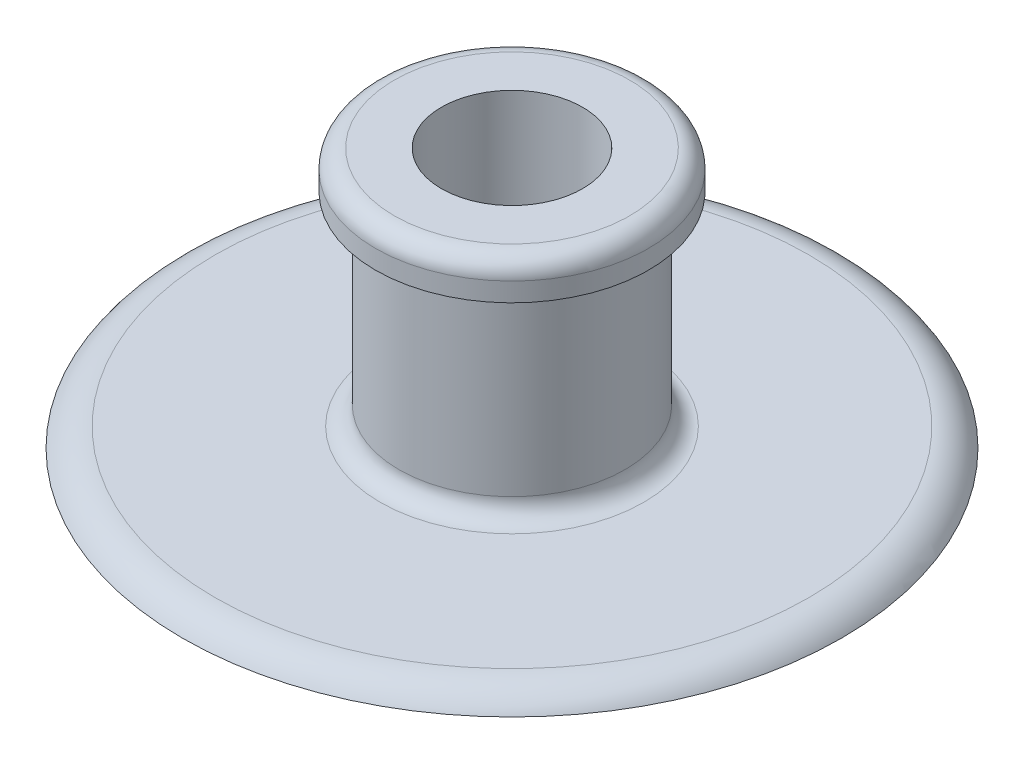
ISO-10303-21;
HEADER;
FILE_DESCRIPTION(('STEP AP214'),'2;1');
FILE_NAME('part.step','',(''),(''),'','','');
FILE_SCHEMA(('AUTOMOTIVE_DESIGN { 1 0 10303 214 1 1 1 1 }'));
ENDSEC;
DATA;
#1=APPLICATION_CONTEXT('core data for automotive mechanical design processes');
#2=APPLICATION_PROTOCOL_DEFINITION('international standard','automotive_design',2000,#1);
#3=PRODUCT_CONTEXT('',#1,'mechanical');
#4=PRODUCT('Part','Part','',(#3));
#5=PRODUCT_RELATED_PRODUCT_CATEGORY('part','',(#4));
#6=PRODUCT_DEFINITION_FORMATION('','',#4);
#7=PRODUCT_DEFINITION_CONTEXT('part definition',#1,'design');
#8=PRODUCT_DEFINITION('design','',#6,#7);
#9=PRODUCT_DEFINITION_SHAPE('','',#8);
#10=(LENGTH_UNIT() NAMED_UNIT(*) SI_UNIT(.MILLI.,.METRE.));
#11=(NAMED_UNIT(*) PLANE_ANGLE_UNIT() SI_UNIT($,.RADIAN.));
#12=(NAMED_UNIT(*) SI_UNIT($,.STERADIAN.) SOLID_ANGLE_UNIT());
#13=UNCERTAINTY_MEASURE_WITH_UNIT(LENGTH_MEASURE(1.E-05),#10,'distance_accuracy_value','');
#14=(GEOMETRIC_REPRESENTATION_CONTEXT(3) GLOBAL_UNCERTAINTY_ASSIGNED_CONTEXT((#13)) GLOBAL_UNIT_ASSIGNED_CONTEXT((#10,
#11,#12)) REPRESENTATION_CONTEXT('',''));
#15=CARTESIAN_POINT('',(0.,0.,0.));
#16=DIRECTION('',(0.,0.,1.));
#17=DIRECTION('',(1.,0.,0.));
#18=AXIS2_PLACEMENT_3D('',#15,#16,#17);
#19=CARTESIAN_POINT('',(0.,17.526,0.));
#20=DIRECTION('',(0.,-1.,0.));
#21=DIRECTION('',(0.,0.,-1.));
#22=AXIS2_PLACEMENT_3D('',#19,#20,#21);
#23=CYLINDRICAL_SURFACE('',#22,7.62);
#24=CARTESIAN_POINT('',(0.,2.54,0.));
#25=DIRECTION('',(0.,1.,0.));
#26=DIRECTION('',(0.,0.,1.));
#27=AXIS2_PLACEMENT_3D('',#24,#25,#26);
#28=CIRCLE('',#27,7.62);
#29=CARTESIAN_POINT('',(-7.60304780992465,2.54,0.508));
#30=VERTEX_POINT('',#29);
#31=CARTESIAN_POINT('',(-7.60304780992465,2.54,-0.508));
#32=VERTEX_POINT('',#31);
#33=EDGE_CURVE('E72',#30,#32,#28,.T.);
#34=ORIENTED_EDGE('',*,*,#33,.T.);
#35=CARTESIAN_POINT('',(-7.60304780992465,2.54,-0.508));
#36=CARTESIAN_POINT('',(-7.60304159913848,2.56854500472977,-0.508024419889921));
#37=CARTESIAN_POINT('',(-7.6032083918163,2.59708204511704,-0.505595520602762));
#38=CARTESIAN_POINT('',(-7.60384202740722,2.65332480571844,-0.496011945855968));
#39=CARTESIAN_POINT('',(-7.60430862281067,2.68103119196927,-0.488861168526517));
#40=CARTESIAN_POINT('',(-7.60549630031561,2.73485838226822,-0.470010144838582));
#41=CARTESIAN_POINT('',(-7.6062174905976,2.76097850675596,-0.458307964317557));
#42=CARTESIAN_POINT('',(-7.60783091050641,2.81087994607243,-0.430697807624481));
#43=CARTESIAN_POINT('',(-7.60872311231095,2.83466164039492,-0.414790515432525));
#44=CARTESIAN_POINT('',(-7.61058014569907,2.87925291563377,-0.379192064712161));
#45=CARTESIAN_POINT('',(-7.61154507770351,2.90005826783693,-0.359495613934338));
#46=CARTESIAN_POINT('',(-7.6134379015252,2.93807280132225,-0.316886882872765));
#47=CARTESIAN_POINT('',(-7.61436578768412,2.95528143493364,-0.293974113728251));
#48=CARTESIAN_POINT('',(-7.61608080018844,2.98562463883698,-0.245559696866007));
#49=CARTESIAN_POINT('',(-7.61686780028951,2.99875556286249,-0.220055759024563));
#50=CARTESIAN_POINT('',(-7.61821120969799,3.0205465398851,-0.167200693188867));
#51=CARTESIAN_POINT('',(-7.61876763585791,3.02920691964289,-0.139849700364712));
#52=CARTESIAN_POINT('',(-7.61958654889922,3.04179977002285,-0.0841184733450809));
#53=CARTESIAN_POINT('',(-7.61984947024981,3.04573922956415,-0.0557398248352981));
#54=CARTESIAN_POINT('',(-7.62005321594405,3.0488000179062,0.0012777706864837));
#55=CARTESIAN_POINT('',(-7.61999403640109,3.04792128856874,0.0299167208352248));
#56=CARTESIAN_POINT('',(-7.61956059875644,3.04137622889067,0.0865930353110984));
#57=CARTESIAN_POINT('',(-7.61918684467766,3.03571755709752,0.114631288448523));
#58=CARTESIAN_POINT('',(-7.61816691307493,3.01978515372002,0.169358959953931));
#59=CARTESIAN_POINT('',(-7.61752073500966,3.00951141296538,0.196048375641614));
#60=CARTESIAN_POINT('',(-7.61602781621613,2.98463160725771,0.24734596255558));
#61=CARTESIAN_POINT('',(-7.61518091110856,2.97002198908397,0.271952405461684));
#62=CARTESIAN_POINT('',(-7.61338188836435,2.9368884878819,0.318365359038743));
#63=CARTESIAN_POINT('',(-7.61242977431608,2.91836473833384,0.340171965149382));
#64=CARTESIAN_POINT('',(-7.6105253392327,2.87788828072959,0.38040947749293));
#65=CARTESIAN_POINT('',(-7.60957302095305,2.8559294156666,0.398834190679327));
#66=CARTESIAN_POINT('',(-7.60777704096159,2.8092192031015,0.431742171811899));
#67=CARTESIAN_POINT('',(-7.6069334131665,2.78446698843656,0.446224211013446));
#68=CARTESIAN_POINT('',(-7.60544970147519,2.73286129533023,0.470836295868986));
#69=CARTESIAN_POINT('',(-7.6048097539302,2.70600642421427,0.480963427769705));
#70=CARTESIAN_POINT('',(-7.60380884052496,2.65100541670298,0.496543834199147));
#71=CARTESIAN_POINT('',(-7.60344745055639,2.62286131268274,0.50200421531452));
#72=CARTESIAN_POINT('',(-7.60311259522002,2.57637816684044,0.50702574474653));
#73=CARTESIAN_POINT('',(-7.60304598021525,2.55818443795279,0.508008081311065));
#74=CARTESIAN_POINT('',(-7.60304780992465,2.54,0.508));
#75=B_SPLINE_CURVE_WITH_KNOTS('',3,(#35,#36,#37,#38,#39,#40,#41,#42,#43,#44,#45,#46,#47,#48,#49,
#50,#51,#52,#53,#54,#55,#56,#57,#58,#59,#60,#61,#62,#63,#64,#65,#66,#67,#68,#69,#70,#71,#72,#73,
#74),.UNSPECIFIED.,.F.,.F.,(4,2,2,2,2,2,2,2,2,2,2,2,2,2,2,2,2,2,2,4),(0.,0.0855198395832717,
0.170969166674459,0.256454846024415,0.341926629295185,0.427518667715244,0.513123729717807,
0.598805120354975,0.684480247487369,0.770028382603848,0.855577549981033,0.940989907689777,
1.02640243511625,1.11188515168982,1.19736495358974,1.28299976067996,1.36866122560895,
1.45437991551918,1.53996783816012,1.59451934799155),.UNSPECIFIED.);
#76=EDGE_CURVE('E63',#32,#30,#75,.T.);
#77=ORIENTED_EDGE('',*,*,#76,.T.);
#78=EDGE_LOOP('',(#34,#77));
#79=FACE_BOUND('',#78,.T.);
#80=CARTESIAN_POINT('',(0.,14.986,0.));
#81=DIRECTION('',(0.,1.,0.));
#82=DIRECTION('',(0.,0.,1.));
#83=AXIS2_PLACEMENT_3D('',#80,#81,#82);
#84=CIRCLE('',#83,7.62);
#85=CARTESIAN_POINT('',(0.,14.986,7.62));
#86=VERTEX_POINT('',#85);
#87=EDGE_CURVE('E234',#86,#86,#84,.T.);
#88=ORIENTED_EDGE('',*,*,#87,.F.);
#89=EDGE_LOOP('',(#88));
#90=FACE_BOUND('',#89,.T.);
#91=ADVANCED_FACE('F33',(#79,#90),#23,.T.);
#92=CARTESIAN_POINT('',(0.,1.27,0.));
#93=DIRECTION('',(0.,1.,0.));
#94=DIRECTION('',(0.,0.,1.));
#95=AXIS2_PLACEMENT_3D('',#92,#93,#94);
#96=PLANE('',#95);
#97=CARTESIAN_POINT('',(0.,1.27,0.));
#98=DIRECTION('',(0.,1.,0.));
#99=DIRECTION('',(0.,0.,1.));
#100=AXIS2_PLACEMENT_3D('',#97,#98,#99);
#101=CIRCLE('',#100,20.0252954743875);
#102=CARTESIAN_POINT('',(0.,1.27,20.0252954743875));
#103=VERTEX_POINT('',#102);
#104=EDGE_CURVE('E67',#103,#103,#101,.T.);
#105=ORIENTED_EDGE('',*,*,#104,.T.);
#106=EDGE_LOOP('',(#105));
#107=FACE_BOUND('',#106,.T.);
#108=CARTESIAN_POINT('',(0.,1.27,0.));
#109=DIRECTION('',(0.,1.,0.));
#110=DIRECTION('',(0.,0.,1.));
#111=AXIS2_PLACEMENT_3D('',#108,#109,#110);
#112=CIRCLE('',#111,8.89);
#113=CARTESIAN_POINT('',(0.,1.27,8.89));
#114=VERTEX_POINT('',#113);
#115=EDGE_CURVE('E68',#114,#114,#112,.F.);
#116=ORIENTED_EDGE('',*,*,#115,.T.);
#117=EDGE_LOOP('',(#116));
#118=FACE_BOUND('',#117,.T.);
#119=ADVANCED_FACE('F133',(#107,#118),#96,.T.);
#120=CARTESIAN_POINT('',(0.,0.,0.));
#121=DIRECTION('',(0.,1.,0.));
#122=DIRECTION('',(0.,0.,1.));
#123=AXIS2_PLACEMENT_3D('',#120,#121,#122);
#124=PLANE('',#123);
#125=CARTESIAN_POINT('',(0.,0.,0.));
#126=DIRECTION('',(0.,1.,0.));
#127=DIRECTION('',(0.,0.,1.));
#128=AXIS2_PLACEMENT_3D('',#125,#126,#127);
#129=CIRCLE('',#128,7.3025);
#130=CARTESIAN_POINT('',(0.,0.,7.3025));
#131=VERTEX_POINT('',#130);
#132=EDGE_CURVE('E244',#131,#131,#129,.T.);
#133=ORIENTED_EDGE('',*,*,#132,.T.);
#134=EDGE_LOOP('',(#133));
#135=FACE_BOUND('',#134,.T.);
#136=CARTESIAN_POINT('',(0.,0.,0.));
#137=DIRECTION('',(0.,1.,0.));
#138=DIRECTION('',(0.,0.,1.));
#139=AXIS2_PLACEMENT_3D('',#136,#137,#138);
#140=CIRCLE('',#139,22.225);
#141=CARTESIAN_POINT('',(0.,0.,22.225));
#142=VERTEX_POINT('',#141);
#143=EDGE_CURVE('E77',#142,#142,#140,.T.);
#144=ORIENTED_EDGE('',*,*,#143,.F.);
#145=EDGE_LOOP('',(#144));
#146=FACE_BOUND('',#145,.T.);
#147=ADVANCED_FACE('F126',(#135,#146),#124,.F.);
#148=CARTESIAN_POINT('',(0.,17.526,0.));
#149=DIRECTION('',(0.,1.,0.));
#150=DIRECTION('',(0.,0.,1.));
#151=AXIS2_PLACEMENT_3D('',#148,#149,#150);
#152=PLANE('',#151);
#153=CARTESIAN_POINT('',(0.,17.526,0.));
#154=DIRECTION('',(0.,1.,0.));
#155=DIRECTION('',(0.,0.,1.));
#156=AXIS2_PLACEMENT_3D('',#153,#154,#155);
#157=CIRCLE('',#156,7.9375);
#158=CARTESIAN_POINT('',(0.,17.526,7.9375));
#159=VERTEX_POINT('',#158);
#160=EDGE_CURVE('E41',#159,#159,#157,.T.);
#161=ORIENTED_EDGE('',*,*,#160,.T.);
#162=EDGE_LOOP('',(#161));
#163=FACE_BOUND('',#162,.T.);
#164=CARTESIAN_POINT('',(0.,17.526,0.));
#165=DIRECTION('',(0.,1.,0.));
#166=DIRECTION('',(0.,0.,1.));
#167=AXIS2_PLACEMENT_3D('',#164,#165,#166);
#168=CIRCLE('',#167,4.7625);
#169=CARTESIAN_POINT('',(0.,17.526,4.7625));
#170=VERTEX_POINT('',#169);
#171=EDGE_CURVE('E82',#170,#170,#168,.T.);
#172=ORIENTED_EDGE('',*,*,#171,.F.);
#173=EDGE_LOOP('',(#172));
#174=FACE_BOUND('',#173,.T.);
#175=ADVANCED_FACE('F124',(#163,#174),#152,.T.);
#176=CARTESIAN_POINT('',(0.,0.,0.));
#177=DIRECTION('',(0.,1.,0.));
#178=DIRECTION('',(0.,0.,1.));
#179=AXIS2_PLACEMENT_3D('',#176,#177,#178);
#180=CYLINDRICAL_SURFACE('',#179,4.7625);
#181=CARTESIAN_POINT('',(-4.73532915962555,2.54,-0.508));
#182=CARTESIAN_POINT('',(-4.73532951382586,2.5115526378655,-0.507998772892873));
#183=CARTESIAN_POINT('',(-4.73558826875959,2.48308671810116,-0.50560242362926));
#184=CARTESIAN_POINT('',(-4.736595126622,2.4269448362749,-0.496079527026681));
#185=CARTESIAN_POINT('',(-4.73734376197426,2.39926976793976,-0.488947832982665));
#186=CARTESIAN_POINT('',(-4.73924463946746,2.34553069389832,-0.470164918632653));
#187=CARTESIAN_POINT('',(-4.74039662972051,2.31946569465578,-0.458516518441869));
#188=CARTESIAN_POINT('',(-4.74297410854784,2.26966613673176,-0.431036426024846));
#189=CARTESIAN_POINT('',(-4.74439954465004,2.24593113226172,-0.415205536165491));
#190=CARTESIAN_POINT('',(-4.74736987687672,2.20136217070842,-0.379739899712918));
#191=CARTESIAN_POINT('',(-4.74891519172266,2.18053916611075,-0.360091423030222));
#192=CARTESIAN_POINT('',(-4.75194737246049,2.14247968292137,-0.317577771402535));
#193=CARTESIAN_POINT('',(-4.75343423561961,2.12524337185562,-0.294712446289726));
#194=CARTESIAN_POINT('',(-4.75618616451338,2.09480828084614,-0.246346556419165));
#195=CARTESIAN_POINT('',(-4.75745069119588,2.0816192573942,-0.220839818936442));
#196=CARTESIAN_POINT('',(-4.75961089945925,2.05971556261992,-0.167957917534795));
#197=CARTESIAN_POINT('',(-4.76050659117781,2.05100076831857,-0.140582804993605));
#198=CARTESIAN_POINT('',(-4.76182526724337,2.03832520885966,-0.0848523131943555));
#199=CARTESIAN_POINT('',(-4.7622500465449,2.03434638751278,-0.0565010838523878));
#200=CARTESIAN_POINT('',(-4.76258514799953,2.03119982683689,0.000469692808714591));
#201=CARTESIAN_POINT('',(-4.76249548518658,2.03203194691388,0.0290892322624054));
#202=CARTESIAN_POINT('',(-4.76181326982975,2.03846903714722,0.0856615842895426));
#203=CARTESIAN_POINT('',(-4.7612227631284,2.04405459083451,0.113616634290427));
#204=CARTESIAN_POINT('',(-4.75960755158236,2.05980972115609,0.168190247448599));
#205=CARTESIAN_POINT('',(-4.7585828404379,2.06997936430015,0.194808791208514));
#206=CARTESIAN_POINT('',(-4.75621088477686,2.09463512615423,0.246014724712021));
#207=CARTESIAN_POINT('',(-4.75486300277581,2.10912979036327,0.270597969053422));
#208=CARTESIAN_POINT('',(-4.75199584180303,2.14201793669936,0.316990245302861));
#209=CARTESIAN_POINT('',(-4.7504765571086,2.16041154902037,0.338799184532182));
#210=CARTESIAN_POINT('',(-4.74742804404275,2.20068455414177,0.379137586231989));
#211=CARTESIAN_POINT('',(-4.74589880382353,2.2225808454003,0.397650180865433));
#212=CARTESIAN_POINT('',(-4.74301026139346,2.26917919741829,0.430739674682816));
#213=CARTESIAN_POINT('',(-4.74165095948828,2.29388126322457,0.445316566787349));
#214=CARTESIAN_POINT('',(-4.73925611632906,2.34540343195827,0.470121044486209));
#215=CARTESIAN_POINT('',(-4.73822065828665,2.37222407704054,0.480347512482386));
#216=CARTESIAN_POINT('',(-4.73659244041184,2.42721531641632,0.496147109141657));
#217=CARTESIAN_POINT('',(-4.73599966518854,2.4553858637411,0.501720399584123));
#218=CARTESIAN_POINT('',(-4.73532663560579,2.51212894902699,0.508033581476389));
#219=CARTESIAN_POINT('',(-4.73524387537722,2.54069882914237,0.508797105281958));
#220=CARTESIAN_POINT('',(-4.73559363033184,2.59755971518757,0.505531215338727));
#221=CARTESIAN_POINT('',(-4.73602613757401,2.62585072540842,0.501501875454968));
#222=CARTESIAN_POINT('',(-4.73735541373918,2.68128143583638,0.488784439609259));
#223=CARTESIAN_POINT('',(-4.73825106236318,2.70842374402493,0.480107583781139));
#224=CARTESIAN_POINT('',(-4.74040479630182,2.7608677740062,0.458352918313546));
#225=CARTESIAN_POINT('',(-4.74166289102139,2.78616944801593,0.445274994471589));
#226=CARTESIAN_POINT('',(-4.74440581317577,2.83432151037095,0.415030495436971));
#227=CARTESIAN_POINT('',(-4.74589149885091,2.85716203784935,0.397848299883193));
#228=CARTESIAN_POINT('',(-4.74891942436523,2.89964330131664,0.359905309728019));
#229=CARTESIAN_POINT('',(-4.75046166579804,2.91928394705426,0.339144414224915));
#230=CARTESIAN_POINT('',(-4.75343652980538,2.95488979038317,0.294530650864962));
#231=CARTESIAN_POINT('',(-4.75486867558593,2.97083954356084,0.270665420709951));
#232=CARTESIAN_POINT('',(-4.75745499933229,2.99850442595484,0.220581262624704));
#233=CARTESIAN_POINT('',(-4.75860918155879,3.01021962008087,0.194362370780406));
#234=CARTESIAN_POINT('',(-4.76050738997387,3.02905682621023,0.140368421082308));
#235=CARTESIAN_POINT('',(-4.76125223984431,3.03618806725091,0.112596613159974));
#236=CARTESIAN_POINT('',(-4.76225124963284,3.04568503550226,0.0562414334513389));
#237=CARTESIAN_POINT('',(-4.76250542537758,3.04805091641934,0.0276580878712928));
#238=CARTESIAN_POINT('',(-4.76249442406272,3.04794767234764,-0.0293573161582148));
#239=CARTESIAN_POINT('',(-4.76223181804067,3.04550248289332,-0.0577894214627581));
#240=CARTESIAN_POINT('',(-4.76122183962384,3.03589682290281,-0.113836422602461));
#241=CARTESIAN_POINT('',(-4.76047446700017,3.0287363501401,-0.141451318051736));
#242=CARTESIAN_POINT('',(-4.75857865213538,3.00991024018507,-0.195079088998818));
#243=CARTESIAN_POINT('',(-4.75743028227927,2.99824541604412,-0.221092252632935));
#244=CARTESIAN_POINT('',(-4.7548602731771,2.97074424140908,-0.270795324910221));
#245=CARTESIAN_POINT('',(-4.75343863432268,2.95490789689355,-0.294485236882979));
#246=CARTESIAN_POINT('',(-4.75047275385545,2.9194236920288,-0.338991949316655));
#247=CARTESIAN_POINT('',(-4.74892795939645,2.89975799840107,-0.359794495293327));
#248=CARTESIAN_POINT('',(-4.74589450123554,2.8572091783192,-0.397814534244706));
#249=CARTESIAN_POINT('',(-4.74440585104329,2.8343252836744,-0.415031168814004));
#250=CARTESIAN_POINT('',(-4.74164868965968,2.78591702424665,-0.445430484647235));
#251=CARTESIAN_POINT('',(-4.74038081933936,2.76038530481219,-0.45860150430038));
#252=CARTESIAN_POINT('',(-4.73821636120305,2.70747486300293,-0.480451472482));
#253=CARTESIAN_POINT('',(-4.73731935848365,2.68009824469617,-0.489135443570986));
#254=CARTESIAN_POINT('',(-4.73622236458374,2.63380811034013,-0.499620328928471));
#255=CARTESIAN_POINT('',(-4.7358890170667,2.61518964295904,-0.502758356931914));
#256=CARTESIAN_POINT('',(-4.73544229770307,2.57771683593938,-0.506948594130032));
#257=CARTESIAN_POINT('',(-4.73532892476713,2.55886249746932,-0.508000813653827));
#258=CARTESIAN_POINT('',(-4.73532915962555,2.54,-0.508));
#259=B_SPLINE_CURVE_WITH_KNOTS('',3,(#181,#182,#183,#184,#185,#186,#187,#188,#189,#190,#191,
#192,#193,#194,#195,#196,#197,#198,#199,#200,#201,#202,#203,#204,#205,#206,#207,#208,#209,#210,
#211,#212,#213,#214,#215,#216,#217,#218,#219,#220,#221,#222,#223,#224,#225,#226,#227,#228,#229,
#230,#231,#232,#233,#234,#235,#236,#237,#238,#239,#240,#241,#242,#243,#244,#245,#246,#247,#248,
#249,#250,#251,#252,#253,#254,#255,#256,#257,#258),.UNSPECIFIED.,.T.,.F.,(4,2,2,2,2,2,2,2,2,2,2,
2,2,2,2,2,2,2,2,2,2,2,2,2,2,2,2,2,2,2,2,2,2,2,2,2,2,2,4),(0.,0.0852731979854953,
0.170639228908172,0.255952045079598,0.341248506748811,0.426857616925051,0.512470724803345,
0.598288621250642,0.684104158774282,0.769591460458316,0.85507626389112,0.94021355222212,
1.0253520758355,1.1106599451783,1.19597066357644,1.28170611156881,1.36744171377811,
1.45319932767422,1.53895395986793,1.6242869136052,1.70961855225383,1.79474473994698,
1.87987313673384,1.96533083411418,2.0507909413748,2.13660243556495,2.22241261433262,
2.30804948273734,2.39368358888598,2.47889273434481,2.56410192003859,2.64929573235677,
2.73448942257695,2.82008978160491,2.90571060839254,2.99157597258376,3.07734501435638,
3.13388710915345,3.190428923948),.UNSPECIFIED.);
#260=CARTESIAN_POINT('',(-4.73532915962556,2.54,0.508));
#261=VERTEX_POINT('',#260);
#262=CARTESIAN_POINT('',(-4.73532915962555,2.54,-0.508));
#263=VERTEX_POINT('',#262);
#264=EDGE_CURVE('E73',#261,#263,#259,.T.);
#265=ORIENTED_EDGE('',*,*,#264,.T.);
#266=CARTESIAN_POINT('',(0.,2.54,0.));
#267=DIRECTION('',(0.,1.,0.));
#268=DIRECTION('',(0.,0.,1.));
#269=AXIS2_PLACEMENT_3D('',#266,#267,#268);
#270=CIRCLE('',#269,4.7625);
#271=EDGE_CURVE('E242',#263,#261,#270,.F.);
#272=ORIENTED_EDGE('',*,*,#271,.T.);
#273=EDGE_LOOP('',(#265,#272));
#274=FACE_BOUND('',#273,.T.);
#275=ORIENTED_EDGE('',*,*,#171,.T.);
#276=EDGE_LOOP('',(#275));
#277=FACE_BOUND('',#276,.T.);
#278=ADVANCED_FACE('F103',(#274,#277),#180,.F.);
#279=CARTESIAN_POINT('',(0.,2.54,0.));
#280=DIRECTION('',(0.,1.,0.));
#281=DIRECTION('',(0.,0.,1.));
#282=AXIS2_PLACEMENT_3D('',#279,#280,#281);
#283=TOROIDAL_SURFACE('',#282,8.89,1.27);
#284=ORIENTED_EDGE('',*,*,#115,.F.);
#285=EDGE_LOOP('',(#284));
#286=FACE_BOUND('',#285,.T.);
#287=ORIENTED_EDGE('',*,*,#33,.F.);
#288=CARTESIAN_POINT('',(-7.60304782833832,2.5402,0.50799996062992));
#289=CARTESIAN_POINT('',(-7.60300669525977,2.51312995186702,0.508040979887228));
#290=CARTESIAN_POINT('',(-7.60404854070505,2.4860935431969,0.505859898925815));
#291=CARTESIAN_POINT('',(-7.60801501050454,2.43294844270137,0.497309382125067));
#292=CARTESIAN_POINT('',(-7.61093147544048,2.40683624536651,0.490958094849602));
#293=CARTESIAN_POINT('',(-7.61836453811013,2.3561795538871,0.474327878864228));
#294=CARTESIAN_POINT('',(-7.62287946267449,2.33163345203738,0.464053056189786));
#295=CARTESIAN_POINT('',(-7.63305746294492,2.28460754684999,0.439929017612284));
#296=CARTESIAN_POINT('',(-7.6387216440673,2.26212976341824,0.426076356825393));
#297=CARTESIAN_POINT('',(-7.65101076060162,2.21851684467513,0.394309920858613));
#298=CARTESIAN_POINT('',(-7.65767149264773,2.19752456525602,0.376214015719608));
#299=CARTESIAN_POINT('',(-7.67103994573985,2.15874984982645,0.336861911622645));
#300=CARTESIAN_POINT('',(-7.6777476873844,2.14096892589577,0.315604232476166));
#301=CARTESIAN_POINT('',(-7.69091920452393,2.1080405699771,0.268958507390018));
#302=CARTESIAN_POINT('',(-7.69734299651797,2.09312058584881,0.243397403924465));
#303=CARTESIAN_POINT('',(-7.70865792072768,2.0678569920306,0.189792842123229));
#304=CARTESIAN_POINT('',(-7.7135500042087,2.05751054030403,0.161750938420794));
#305=CARTESIAN_POINT('',(-7.72088303829635,2.04229922001545,0.105617628354277));
#306=CARTESIAN_POINT('',(-7.7234461622246,2.03715925812726,0.0776173556728126));
#307=CARTESIAN_POINT('',(-7.72620066172897,2.03164236083473,0.0210428479759943));
#308=CARTESIAN_POINT('',(-7.72639358420905,2.03126231888161,-0.00753100049695309));
#309=CARTESIAN_POINT('',(-7.72447672237804,2.0350928918321,-0.0616551710096112));
#310=CARTESIAN_POINT('',(-7.72257507015572,2.03888853847333,-0.0872438376982828));
#311=CARTESIAN_POINT('',(-7.71703179228452,2.0502509699488,-0.137370245387354));
#312=CARTESIAN_POINT('',(-7.71338985643888,2.05781842709958,-0.161907798182054));
#313=CARTESIAN_POINT('',(-7.70468313250384,2.07663952805852,-0.209853606665421));
#314=CARTESIAN_POINT('',(-7.69959026884802,2.08796671877026,-0.233227662474154));
#315=CARTESIAN_POINT('',(-7.68853896059589,2.11392796760353,-0.277836970162899));
#316=CARTESIAN_POINT('',(-7.68258013001702,2.12856350195883,-0.299071261112778));
#317=CARTESIAN_POINT('',(-7.66973718080216,2.16242292717745,-0.341022530304967));
#318=CARTESIAN_POINT('',(-7.66281993689394,2.18195812075989,-0.361478780112788));
#319=CARTESIAN_POINT('',(-7.6493176301877,2.22422155358519,-0.398930431363161));
#320=CARTESIAN_POINT('',(-7.64273272146977,2.24695125574255,-0.415924238407926));
#321=CARTESIAN_POINT('',(-7.63035758006949,2.29601092956334,-0.446541672481798));
#322=CARTESIAN_POINT('',(-7.62460519983961,2.32244214197839,-0.460019380321741));
#323=CARTESIAN_POINT('',(-7.61488610845989,2.37751487351705,-0.482224399765329));
#324=CARTESIAN_POINT('',(-7.61091631669582,2.40615247846275,-0.49095991218766));
#325=CARTESIAN_POINT('',(-7.60643155161561,2.45258477086746,-0.50073073126521));
#326=CARTESIAN_POINT('',(-7.60516679725416,2.46996815534492,-0.503456393267749));
#327=CARTESIAN_POINT('',(-7.60347063458016,2.50496355134837,-0.507096254465517));
#328=CARTESIAN_POINT('',(-7.60303924520609,2.52257556806095,-0.508010412493767));
#329=CARTESIAN_POINT('',(-7.60304782833832,2.5402,-0.50799996062992));
#330=B_SPLINE_CURVE_WITH_KNOTS('',3,(#288,#289,#290,#291,#292,#293,#294,#295,#296,#297,#298,
#299,#300,#301,#302,#303,#304,#305,#306,#307,#308,#309,#310,#311,#312,#313,#314,#315,#316,#317,
#318,#319,#320,#321,#322,#323,#324,#325,#326,#327,#328,#329),.UNSPECIFIED.,.F.,.F.,(4,2,2,2,2,2,
2,2,2,2,2,2,2,2,2,2,2,2,2,2,4),(0.,0.0810468942166705,0.16174339294758,0.242355672068513,
0.32304585911805,0.408195438756082,0.493385007484565,0.583782522410819,0.67412378421875,
0.759393995370394,0.844608552248701,0.922061693800123,0.999528646135341,1.07861031685972,
1.15772734494265,1.24470033911795,1.33171329285565,1.42190726879266,1.51194476868668,
1.56476349531595,1.61758342225309),.UNSPECIFIED.);
#331=EDGE_CURVE('E60',#30,#32,#330,.T.);
#332=ORIENTED_EDGE('',*,*,#331,.T.);
#333=EDGE_LOOP('',(#287,#332));
#334=FACE_BOUND('',#333,.T.);
#335=ADVANCED_FACE('F76',(#286,#334),#283,.F.);
#336=CARTESIAN_POINT('',(-22.225,2.54,0.));
#337=DIRECTION('',(1.,0.,0.));
#338=DIRECTION('',(0.,0.,-1.));
#339=AXIS2_PLACEMENT_3D('',#336,#337,#338);
#340=CYLINDRICAL_SURFACE('',#339,0.508);
#341=ORIENTED_EDGE('',*,*,#331,.F.);
#342=ORIENTED_EDGE('',*,*,#76,.F.);
#343=EDGE_LOOP('',(#341,#342));
#344=FACE_BOUND('',#343,.T.);
#345=ORIENTED_EDGE('',*,*,#264,.F.);
#346=CARTESIAN_POINT('',(-4.73532915962555,2.54,0.508));
#347=CARTESIAN_POINT('',(-4.73530208651431,2.51210056288138,0.508027184730686));
#348=CARTESIAN_POINT('',(-4.73603723486519,2.48422235459689,0.505703581040537));
#349=CARTESIAN_POINT('',(-4.73882554860994,2.42934735363915,0.496572329856997));
#350=CARTESIAN_POINT('',(-4.74087537613687,2.40234851022644,0.489776037031478));
#351=CARTESIAN_POINT('',(-4.74608777763052,2.34993001296422,0.47191759001736));
#352=CARTESIAN_POINT('',(-4.74925002493559,2.32450989809707,0.460856688038213));
#353=CARTESIAN_POINT('',(-4.75633724838616,2.27587429682799,0.434813273266805));
#354=CARTESIAN_POINT('',(-4.76026255376517,2.25265976852118,0.419829066730956));
#355=CARTESIAN_POINT('',(-4.76858061380271,2.20840246554254,0.385883419945301));
#356=CARTESIAN_POINT('',(-4.77298319488686,2.187436153025,0.366824686671019));
#357=CARTESIAN_POINT('',(-4.78168977171904,2.14894225802671,0.325477944058389));
#358=CARTESIAN_POINT('',(-4.7859937475392,2.13141536532262,0.303189288513142));
#359=CARTESIAN_POINT('',(-4.79412403745192,2.09992617819218,0.255411820188596));
#360=CARTESIAN_POINT('',(-4.79793775952631,2.08605079012715,0.229863390541902));
#361=CARTESIAN_POINT('',(-4.80452376041428,2.0628248567925,0.176662671831094));
#362=CARTESIAN_POINT('',(-4.80729632707011,2.05347306070511,0.14901096679348));
#363=CARTESIAN_POINT('',(-4.81139983317782,2.03982623398257,0.0932253144822323));
#364=CARTESIAN_POINT('',(-4.81276977890027,2.03539407565575,0.0651278474678525));
#365=CARTESIAN_POINT('',(-4.81403969627682,2.03128138940045,0.00855652701426931));
#366=CARTESIAN_POINT('',(-4.81393997403638,2.03159987199883,-0.0199172468126269));
#367=CARTESIAN_POINT('',(-4.81231281075075,2.03687976394538,-0.0753900636910849));
#368=CARTESIAN_POINT('',(-4.81083477672177,2.04168050911706,-0.102406083094075));
#369=CARTESIAN_POINT('',(-4.80668857501686,2.05552754235967,-0.155229290926899));
#370=CARTESIAN_POINT('',(-4.80402032300565,2.06457413128072,-0.181036393553307));
#371=CARTESIAN_POINT('',(-4.79774230331515,2.08676929955442,-0.231095991995137));
#372=CARTESIAN_POINT('',(-4.79412089149915,2.09996903473447,-0.255324284708762));
#373=CARTESIAN_POINT('',(-4.78633673105168,2.13005801899449,-0.301274305636661));
#374=CARTESIAN_POINT('',(-4.78217385757524,2.14694811957551,-0.322995453591112));
#375=CARTESIAN_POINT('',(-4.77356112838316,2.18474953143406,-0.364246010990041));
#376=CARTESIAN_POINT('',(-4.76910648740498,2.20579648460389,-0.383650300292918));
#377=CARTESIAN_POINT('',(-4.76056087749238,2.25090086767799,-0.418689907656729));
#378=CARTESIAN_POINT('',(-4.75647000719897,2.27495910989922,-0.434324205392228));
#379=CARTESIAN_POINT('',(-4.74907970902559,2.32568285522374,-0.461483777163369));
#380=CARTESIAN_POINT('',(-4.7457875030087,2.35236928817805,-0.472971983856065));
#381=CARTESIAN_POINT('',(-4.74043818567621,2.40740504195202,-0.491243514782174));
#382=CARTESIAN_POINT('',(-4.73837923006706,2.4357518097341,-0.498033866903608));
#383=CARTESIAN_POINT('',(-4.73648728167499,2.47696936710473,-0.504233843805975));
#384=CARTESIAN_POINT('',(-4.73605386343137,2.48953947916897,-0.505646006491872));
#385=CARTESIAN_POINT('',(-4.73547479116797,2.51473760537945,-0.507528233852422));
#386=CARTESIAN_POINT('',(-4.73532870569602,2.52736550412904,-0.50799971105372));
#387=CARTESIAN_POINT('',(-4.73532915962557,2.54,-0.508000000000001));
#388=B_SPLINE_CURVE_WITH_KNOTS('',3,(#346,#347,#348,#349,#350,#351,#352,#353,#354,#355,#356,
#357,#358,#359,#360,#361,#362,#363,#364,#365,#366,#367,#368,#369,#370,#371,#372,#373,#374,#375,
#376,#377,#378,#379,#380,#381,#382,#383,#384,#385,#386,#387),.UNSPECIFIED.,.F.,.F.,(4,2,2,2,2,2,
2,2,2,2,2,2,2,2,2,2,2,2,2,2,4),(0.,0.0835591821646333,0.16690704948251,0.250230462132487,
0.333589906107845,0.419221953029447,0.504871155971731,0.592404684504692,0.679913995298466,
0.764917567138169,0.849903434508657,0.931955392407692,1.01401316518603,1.09712408777547,
1.18025420735656,1.26676636903274,1.35330191848934,1.44059300289404,1.52775321771758,
1.56569104248835,1.60357185708759),.UNSPECIFIED.);
#389=EDGE_CURVE('E47',#261,#263,#388,.T.);
#390=ORIENTED_EDGE('',*,*,#389,.T.);
#391=EDGE_LOOP('',(#345,#390));
#392=FACE_BOUND('',#391,.T.);
#393=ADVANCED_FACE('F62',(#344,#392),#340,.F.);
#394=CARTESIAN_POINT('',(0.,-1.27,0.));
#395=DIRECTION('',(0.,-1.,0.));
#396=DIRECTION('',(0.,0.,-1.));
#397=AXIS2_PLACEMENT_3D('',#394,#395,#396);
#398=TOROIDAL_SURFACE('',#397,20.0252954743875,2.54);
#399=ORIENTED_EDGE('',*,*,#143,.T.);
#400=EDGE_LOOP('',(#399));
#401=FACE_BOUND('',#400,.T.);
#402=ORIENTED_EDGE('',*,*,#104,.F.);
#403=EDGE_LOOP('',(#402));
#404=FACE_BOUND('',#403,.T.);
#405=ADVANCED_FACE('F100',(#401,#404),#398,.T.);
#406=CARTESIAN_POINT('',(0.,2.54,0.));
#407=DIRECTION('',(0.,1.,0.));
#408=DIRECTION('',(0.,0.,1.));
#409=AXIS2_PLACEMENT_3D('',#406,#407,#408);
#410=TOROIDAL_SURFACE('',#409,7.3025,2.54);
#411=ORIENTED_EDGE('',*,*,#389,.F.);
#412=ORIENTED_EDGE('',*,*,#271,.F.);
#413=EDGE_LOOP('',(#411,#412));
#414=FACE_BOUND('',#413,.T.);
#415=ORIENTED_EDGE('',*,*,#132,.F.);
#416=EDGE_LOOP('',(#415));
#417=FACE_BOUND('',#416,.T.);
#418=ADVANCED_FACE('F166',(#414,#417),#410,.T.);
#419=CARTESIAN_POINT('',(0.,19.9166096245642,0.));
#420=DIRECTION('',(0.,1.,0.));
#421=DIRECTION('',(0.,0.,1.));
#422=AXIS2_PLACEMENT_3D('',#419,#420,#421);
#423=CYLINDRICAL_SURFACE('',#422,9.2075);
#424=CARTESIAN_POINT('',(0.,16.256,0.));
#425=DIRECTION('',(0.,1.,0.));
#426=DIRECTION('',(0.,0.,1.));
#427=AXIS2_PLACEMENT_3D('',#424,#425,#426);
#428=CIRCLE('',#427,9.2075);
#429=CARTESIAN_POINT('',(0.,16.256,9.2075));
#430=VERTEX_POINT('',#429);
#431=EDGE_CURVE('E11',#430,#430,#428,.F.);
#432=ORIENTED_EDGE('',*,*,#431,.T.);
#433=EDGE_LOOP('',(#432));
#434=FACE_BOUND('',#433,.T.);
#435=CARTESIAN_POINT('',(0.,14.986,0.));
#436=DIRECTION('',(0.,1.,0.));
#437=DIRECTION('',(0.,0.,1.));
#438=AXIS2_PLACEMENT_3D('',#435,#436,#437);
#439=CIRCLE('',#438,9.2075);
#440=CARTESIAN_POINT('',(0.,14.986,9.2075));
#441=VERTEX_POINT('',#440);
#442=EDGE_CURVE('E74',#441,#441,#439,.T.);
#443=ORIENTED_EDGE('',*,*,#442,.T.);
#444=EDGE_LOOP('',(#443));
#445=FACE_BOUND('',#444,.T.);
#446=ADVANCED_FACE('F101',(#434,#445),#423,.T.);
#447=CARTESIAN_POINT('',(9.2075,14.986,0.));
#448=DIRECTION('',(0.,1.,0.));
#449=DIRECTION('',(0.,0.,1.));
#450=AXIS2_PLACEMENT_3D('',#447,#448,#449);
#451=PLANE('',#450);
#452=ORIENTED_EDGE('',*,*,#442,.F.);
#453=EDGE_LOOP('',(#452));
#454=FACE_BOUND('',#453,.T.);
#455=ORIENTED_EDGE('',*,*,#87,.T.);
#456=EDGE_LOOP('',(#455));
#457=FACE_BOUND('',#456,.T.);
#458=ADVANCED_FACE('F178',(#454,#457),#451,.F.);
#459=CARTESIAN_POINT('',(0.,16.256,0.));
#460=DIRECTION('',(0.,1.,0.));
#461=DIRECTION('',(0.,0.,1.));
#462=AXIS2_PLACEMENT_3D('',#459,#460,#461);
#463=TOROIDAL_SURFACE('',#462,7.9375,1.27);
#464=ORIENTED_EDGE('',*,*,#431,.F.);
#465=EDGE_LOOP('',(#464));
#466=FACE_BOUND('',#465,.T.);
#467=ORIENTED_EDGE('',*,*,#160,.F.);
#468=EDGE_LOOP('',(#467));
#469=FACE_BOUND('',#468,.T.);
#470=ADVANCED_FACE('F35',(#466,#469),#463,.T.);
#471=CLOSED_SHELL('',(#91,#119,#147,#175,#278,#335,#393,#405,#418,#446,#458,#470));
#472=MANIFOLD_SOLID_BREP('B2',#471);
#473=ADVANCED_BREP_SHAPE_REPRESENTATION('',(#18,#472),#14);
#474=SHAPE_DEFINITION_REPRESENTATION(#9,#473);
ENDSEC;
END-ISO-10303-21;
